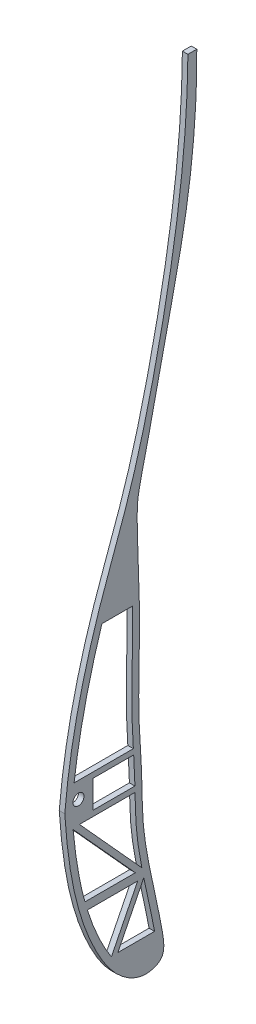
ISO-10303-21;
HEADER;
FILE_DESCRIPTION(('STEP AP214'),'2;1');
FILE_NAME('part.step','',(''),(''),'','','');
FILE_SCHEMA(('AUTOMOTIVE_DESIGN { 1 0 10303 214 1 1 1 1 }'));
ENDSEC;
DATA;
#1=APPLICATION_CONTEXT('core data for automotive mechanical design processes');
#2=APPLICATION_PROTOCOL_DEFINITION('international standard','automotive_design',2000,#1);
#3=PRODUCT_CONTEXT('',#1,'mechanical');
#4=PRODUCT('Part','Part','',(#3));
#5=PRODUCT_RELATED_PRODUCT_CATEGORY('part','',(#4));
#6=PRODUCT_DEFINITION_FORMATION('','',#4);
#7=PRODUCT_DEFINITION_CONTEXT('part definition',#1,'design');
#8=PRODUCT_DEFINITION('design','',#6,#7);
#9=PRODUCT_DEFINITION_SHAPE('','',#8);
#10=(LENGTH_UNIT() NAMED_UNIT(*) SI_UNIT(.MILLI.,.METRE.));
#11=(NAMED_UNIT(*) PLANE_ANGLE_UNIT() SI_UNIT($,.RADIAN.));
#12=(NAMED_UNIT(*) SI_UNIT($,.STERADIAN.) SOLID_ANGLE_UNIT());
#13=UNCERTAINTY_MEASURE_WITH_UNIT(LENGTH_MEASURE(1.E-05),#10,'distance_accuracy_value','');
#14=(GEOMETRIC_REPRESENTATION_CONTEXT(3) GLOBAL_UNCERTAINTY_ASSIGNED_CONTEXT((#13)) GLOBAL_UNIT_ASSIGNED_CONTEXT((#10,
#11,#12)) REPRESENTATION_CONTEXT('',''));
#15=CARTESIAN_POINT('',(0.,0.,0.));
#16=DIRECTION('',(0.,0.,1.));
#17=DIRECTION('',(1.,0.,0.));
#18=AXIS2_PLACEMENT_3D('',#15,#16,#17);
#19=CARTESIAN_POINT('',(2.,481.202019363454,-785.880852032556));
#20=DIRECTION('',(1.,0.,0.));
#21=DIRECTION('',(0.,0.,-1.));
#22=AXIS2_PLACEMENT_3D('',#19,#20,#21);
#23=PLANE('',#22);
#24=CARTESIAN_POINT('',(2.,340.385908262819,-765.512588052985));
#25=CARTESIAN_POINT('',(2.,339.008160637667,-765.942062452033));
#26=CARTESIAN_POINT('',(2.,335.196727706703,-767.22554902468));
#27=CARTESIAN_POINT('',(2.,330.291102646001,-769.261685790927));
#28=CARTESIAN_POINT('',(2.,325.640152405952,-771.608947919703));
#29=CARTESIAN_POINT('',(2.,323.059967565287,-773.096725597255));
#30=CARTESIAN_POINT('',(2.,321.674751511096,-774.004343098112));
#31=CARTESIAN_POINT('',(2.,321.355424184377,-774.220368212697));
#32=B_SPLINE_CURVE_WITH_KNOTS('',3,(#24,#25,#26,#27,#28,#29,#30,#31),.UNSPECIFIED.,.F.,.F.,(4,1,
1,1,1,4),(0.0697506622808374,0.0784831388022607,0.0941020686530699,0.101911533578474,
0.109720998503879,0.112105213874492),.UNSPECIFIED.);
#33=CARTESIAN_POINT('',(2.,340.385908262819,-765.512588052985));
#34=VERTEX_POINT('',#33);
#35=CARTESIAN_POINT('',(2.,321.355424184377,-774.220368212697));
#36=VERTEX_POINT('',#35);
#37=EDGE_CURVE('E249',#34,#36,#32,.T.);
#38=ORIENTED_EDGE('',*,*,#37,.F.);
#39=DIRECTION('',(0.,2.61948278448674E-13,1.));
#40=VECTOR('',#39,1.);
#41=CARTESIAN_POINT('',(2.,340.385908262819,-765.512588052985));
#42=LINE('',#41,#40);
#43=CARTESIAN_POINT('',(2.,340.385908262814,-783.737403402644));
#44=VERTEX_POINT('',#43);
#45=EDGE_CURVE('E257',#44,#34,#42,.T.);
#46=ORIENTED_EDGE('',*,*,#45,.F.);
#47=DIRECTION('',(0.,0.894393478705473,-0.447281013736468));
#48=VECTOR('',#47,1.);
#49=CARTESIAN_POINT('',(2.,340.385908262814,-783.737403402644));
#50=LINE('',#49,#48);
#51=EDGE_CURVE('E256',#36,#44,#50,.T.);
#52=ORIENTED_EDGE('',*,*,#51,.F.);
#53=EDGE_LOOP('',(#38,#46,#52));
#54=FACE_BOUND('',#53,.T.);
#55=DIRECTION('',(0.,0.740403338776906,0.672162849262));
#56=VECTOR('',#55,1.);
#57=CARTESIAN_POINT('',(2.,343.385908235926,-782.893255333231));
#58=LINE('',#57,#56);
#59=CARTESIAN_POINT('',(2.,343.385908235926,-782.893255333231));
#60=VERTEX_POINT('',#59);
#61=CARTESIAN_POINT('',(2.,368.21087997734,-760.356317876787));
#62=VERTEX_POINT('',#61);
#63=EDGE_CURVE('E289',#60,#62,#58,.T.);
#64=ORIENTED_EDGE('',*,*,#63,.F.);
#65=DIRECTION('',(0.,0.,-1.));
#66=VECTOR('',#65,1.);
#67=CARTESIAN_POINT('',(2.,343.385908235926,-764.629795023823));
#68=LINE('',#67,#66);
#69=CARTESIAN_POINT('',(2.,343.385908235926,-764.629795023823));
#70=VERTEX_POINT('',#69);
#71=EDGE_CURVE('E287',#70,#60,#68,.T.);
#72=ORIENTED_EDGE('',*,*,#71,.F.);
#73=CARTESIAN_POINT('',(2.,368.21087997734,-760.356317876787));
#74=CARTESIAN_POINT('',(2.,365.108328869822,-760.645542864691));
#75=CARTESIAN_POINT('',(2.,359.399798980375,-761.297099333512));
#76=CARTESIAN_POINT('',(2.,351.207948443267,-762.68556128646));
#77=CARTESIAN_POINT('',(2.,346.064289496861,-763.890877385841));
#78=CARTESIAN_POINT('',(2.,343.478926304313,-764.603996250646));
#79=CARTESIAN_POINT('',(2.,343.385908235926,-764.629795023823));
#80=B_SPLINE_CURVE_WITH_KNOTS('',3,(#73,#74,#75,#76,#77,#78,#79),.UNSPECIFIED.,.F.,.F.,(4,1,1,1,
4),(0.0131300298220132,0.0316263492498333,0.0472452791006425,0.0628642089514516,
0.0634474168728754),.UNSPECIFIED.);
#81=EDGE_CURVE('E293',#62,#70,#80,.T.);
#82=ORIENTED_EDGE('',*,*,#81,.F.);
#83=EDGE_LOOP('',(#64,#72,#82));
#84=FACE_BOUND('',#83,.T.);
#85=DIRECTION('',(0.,1.01853799661805E-12,1.));
#86=VECTOR('',#85,1.);
#87=CARTESIAN_POINT('',(2.,368.641580619222,-762.664726398492));
#88=LINE('',#87,#86);
#89=CARTESIAN_POINT('',(2.,368.641580619201,-782.775527244752));
#90=VERTEX_POINT('',#89);
#91=CARTESIAN_POINT('',(2.,368.641580619222,-762.664726398492));
#92=VERTEX_POINT('',#91);
#93=EDGE_CURVE('E336',#90,#92,#88,.T.);
#94=ORIENTED_EDGE('',*,*,#93,.F.);
#95=CARTESIAN_POINT('',(2.,343.762046235807,-785.235370080908));
#96=CARTESIAN_POINT('',(2.,345.435849462761,-784.911737530228));
#97=CARTESIAN_POINT('',(2.,348.412605530944,-784.369480265957));
#98=CARTESIAN_POINT('',(2.,352.846020065259,-783.683400447358));
#99=CARTESIAN_POINT('',(2.,358.350652792806,-783.092319972168));
#100=CARTESIAN_POINT('',(2.,363.619677576016,-782.886598015306));
#101=CARTESIAN_POINT('',(2.,367.500970974049,-782.801054433292));
#102=CARTESIAN_POINT('',(2.,368.641580619201,-782.775527244752));
#103=B_SPLINE_CURVE_WITH_KNOTS('',3,(#95,#96,#97,#98,#99,#100,#101,#102),.UNSPECIFIED.,.F.,.F.,
(4,1,1,1,1,4),(0.224345048321059,0.234672437310352,0.242481902235757,0.250291367161161,
0.26591029701197,0.272429812364704),.UNSPECIFIED.);
#104=CARTESIAN_POINT('',(2.,343.762046236129,-785.235370081016));
#105=VERTEX_POINT('',#104);
#106=EDGE_CURVE('E330',#105,#90,#103,.T.);
#107=ORIENTED_EDGE('',*,*,#106,.F.);
#108=DIRECTION('',(0.,-0.74063778163558,-0.671904514357454));
#109=VECTOR('',#108,1.);
#110=CARTESIAN_POINT('',(2.,343.762046236129,-785.235370081016));
#111=LINE('',#110,#109);
#112=EDGE_CURVE('E345',#92,#105,#111,.T.);
#113=ORIENTED_EDGE('',*,*,#112,.F.);
#114=EDGE_LOOP('',(#94,#107,#113));
#115=FACE_BOUND('',#114,.T.);
#116=DIRECTION('',(0.,-0.894393513688275,0.44728094378404));
#117=VECTOR('',#116,1.);
#118=CARTESIAN_POINT('',(2.,340.297979165982,-785.929582763325));
#119=LINE('',#118,#117);
#120=CARTESIAN_POINT('',(2.,340.297979165982,-785.929582763325));
#121=VERTEX_POINT('',#120);
#122=CARTESIAN_POINT('',(2.,321.529397961903,-776.543525523454));
#123=VERTEX_POINT('',#122);
#124=EDGE_CURVE('E374',#121,#123,#119,.T.);
#125=ORIENTED_EDGE('',*,*,#124,.F.);
#126=CARTESIAN_POINT('',(2.,321.529397961903,-789.845927053336));
#127=CARTESIAN_POINT('',(2.,321.699503823298,-789.814167011017));
#128=CARTESIAN_POINT('',(2.,322.038893566124,-789.750428920361));
#129=CARTESIAN_POINT('',(2.,323.580698572305,-789.457737754349));
#130=CARTESIAN_POINT('',(2.,326.240421286965,-788.929454000009));
#131=CARTESIAN_POINT('',(2.,329.952624524179,-788.149638114499));
#132=CARTESIAN_POINT('',(2.,333.72403688345,-787.332530561591));
#133=CARTESIAN_POINT('',(2.,337.157851053267,-786.588165074445));
#134=CARTESIAN_POINT('',(2.,339.349407118532,-786.125599329134));
#135=CARTESIAN_POINT('',(2.,340.297979165982,-785.929582763325));
#136=B_SPLINE_CURVE_WITH_KNOTS('',3,(#126,#127,#128,#129,#130,#131,#132,#133,#134,#135),
.UNSPECIFIED.,.F.,.F.,(4,1,1,1,1,1,1,4),(0.178917784035079,0.179893967151298,0.180870150266974,
0.187815647757925,0.195625112683329,0.203434577608734,0.211244042534138,0.217170107358208),.UNSPECIFIED.);
#137=CARTESIAN_POINT('',(2.,321.529397961903,-789.845927053336));
#138=VERTEX_POINT('',#137);
#139=EDGE_CURVE('E369',#138,#121,#136,.T.);
#140=ORIENTED_EDGE('',*,*,#139,.F.);
#141=DIRECTION('',(0.,0.,-1.));
#142=VECTOR('',#141,1.);
#143=CARTESIAN_POINT('',(2.,321.529397961903,-776.543525523454));
#144=LINE('',#143,#142);
#145=EDGE_CURVE('E496',#123,#138,#144,.T.);
#146=ORIENTED_EDGE('',*,*,#145,.F.);
#147=EDGE_LOOP('',(#125,#140,#146));
#148=FACE_BOUND('',#147,.T.);
#149=DIRECTION('',(0.,0.,-1.));
#150=VECTOR('',#149,1.);
#151=CARTESIAN_POINT('',(2.,382.641580619201,-760.713816226627));
#152=LINE('',#151,#150);
#153=CARTESIAN_POINT('',(2.,382.641580619201,-760.713816226627));
#154=VERTEX_POINT('',#153);
#155=CARTESIAN_POINT('',(2.,382.641580619201,-782.158524772029));
#156=VERTEX_POINT('',#155);
#157=EDGE_CURVE('E405',#154,#156,#152,.T.);
#158=ORIENTED_EDGE('',*,*,#157,.F.);
#159=CARTESIAN_POINT('',(2.,427.491820966125,-770.78664309846));
#160=CARTESIAN_POINT('',(2.,423.33866525662,-769.467056163945));
#161=CARTESIAN_POINT('',(2.,414.7700614056,-766.964736871384));
#162=CARTESIAN_POINT('',(2.,399.851527625685,-763.380449780048));
#163=CARTESIAN_POINT('',(2.,389.014059475878,-761.525068294202));
#164=CARTESIAN_POINT('',(2.,382.641580619201,-760.713816226627));
#165=B_SPLINE_CURVE_WITH_KNOTS('',3,(#159,#160,#161,#162,#163,#164),.UNSPECIFIED.,.F.,.F.,(4,1,
1,4),(0.75216752707801,0.811772657665889,0.874216708255573,0.962264248056751),.UNSPECIFIED.);
#166=CARTESIAN_POINT('',(2.,427.491820966125,-770.78664309846));
#167=VERTEX_POINT('',#166);
#168=EDGE_CURVE('E435',#167,#154,#165,.T.);
#169=ORIENTED_EDGE('',*,*,#168,.F.);
#170=DIRECTION('',(0.,0.,1.));
#171=VECTOR('',#170,1.);
#172=CARTESIAN_POINT('',(2.,427.491820966125,-770.78664309846));
#173=LINE('',#172,#171);
#174=CARTESIAN_POINT('',(2.,427.491820966125,-781.8143913991));
#175=VERTEX_POINT('',#174);
#176=EDGE_CURVE('E404',#175,#167,#173,.T.);
#177=ORIENTED_EDGE('',*,*,#176,.F.);
#178=CARTESIAN_POINT('',(2.,382.641580619201,-782.158524772029));
#179=CARTESIAN_POINT('',(2.,384.984999743043,-782.009801346982));
#180=CARTESIAN_POINT('',(2.,392.72879678058,-781.532269832097));
#181=CARTESIAN_POINT('',(2.,402.504492041581,-781.601558596643));
#182=CARTESIAN_POINT('',(2.,413.028444882909,-781.812144771197));
#183=CARTESIAN_POINT('',(2.,420.046613203179,-781.889539878955));
#184=CARTESIAN_POINT('',(2.,425.00787778219,-781.856336873659));
#185=CARTESIAN_POINT('',(2.,427.030653456843,-781.822920811895));
#186=CARTESIAN_POINT('',(2.,427.491820966125,-781.8143913991));
#187=B_SPLINE_CURVE_WITH_KNOTS('',3,(#178,#179,#180,#181,#182,#183,#184,#185,#186),
.UNSPECIFIED.,.F.,.F.,(4,1,1,1,1,1,4),(0.299279434855956,0.312767086564398,0.344004946266016,
0.359623876116825,0.375242805967634,0.383052270893039,0.385336265488092),.UNSPECIFIED.);
#188=EDGE_CURVE('E397',#156,#175,#187,.T.);
#189=ORIENTED_EDGE('',*,*,#188,.F.);
#190=EDGE_LOOP('',(#158,#169,#177,#189));
#191=FACE_BOUND('',#190,.T.);
#192=CARTESIAN_POINT('',(2.,590.408064710771,-801.906188373582));
#193=CARTESIAN_POINT('',(2.,560.152145615693,-801.696580445326));
#194=CARTESIAN_POINT('',(2.,516.437213248744,-794.998743298671));
#195=CARTESIAN_POINT('',(2.,464.922235888547,-781.936959969809));
#196=CARTESIAN_POINT('',(2.,424.310340527531,-766.027657555779));
#197=CARTESIAN_POINT('',(2.,395.318637871251,-759.177489387421));
#198=CARTESIAN_POINT('',(2.,374.654040422638,-757.334151871242));
#199=B_SPLINE_CURVE_WITH_KNOTS('',3,(#192,#193,#194,#195,#196,#197,#198),.UNSPECIFIED.,.F.,.F.,
(4,1,1,1,4),(0.,0.40882599508886,0.59851771432939,0.719267244538079,1.),.UNSPECIFIED.);
#200=CARTESIAN_POINT('',(2.,590.408064710771,-801.906188373582));
#201=VERTEX_POINT('',#200);
#202=CARTESIAN_POINT('',(2.,374.654040422638,-757.334151871242));
#203=VERTEX_POINT('',#202);
#204=EDGE_CURVE('E445',#201,#203,#199,.T.);
#205=ORIENTED_EDGE('',*,*,#204,.T.);
#206=CARTESIAN_POINT('',(2.,374.654040422638,-757.334151871242));
#207=CARTESIAN_POINT('',(2.,357.641582882345,-758.488618023892));
#208=CARTESIAN_POINT('',(2.,335.0381499136,-761.828045075014));
#209=CARTESIAN_POINT('',(2.,313.183311775303,-776.364446291571));
#210=CARTESIAN_POINT('',(2.,308.841980468108,-785.880697371213));
#211=CARTESIAN_POINT('',(2.,310.610251685068,-791.313928595472));
#212=CARTESIAN_POINT('',(2.,312.987941846461,-793.075385029442));
#213=CARTESIAN_POINT('',(2.,316.107743129073,-793.337462446664));
#214=CARTESIAN_POINT('',(2.,329.643146103394,-791.041438182055));
#215=CARTESIAN_POINT('',(2.,341.196605560739,-787.95599236507));
#216=CARTESIAN_POINT('',(2.,359.620713161168,-785.204159750693));
#217=CARTESIAN_POINT('',(2.,372.997065252505,-785.453788794671));
#218=CARTESIAN_POINT('',(2.,397.430131693857,-783.431517771397));
#219=CARTESIAN_POINT('',(2.,420.762517316124,-785.24761534817));
#220=CARTESIAN_POINT('',(2.,455.809656019197,-783.053458862603));
#221=CARTESIAN_POINT('',(2.,464.386743167617,-784.469445240221));
#222=CARTESIAN_POINT('',(2.,479.293540681458,-788.132816832003));
#223=CARTESIAN_POINT('',(2.,503.980467437628,-793.242767846079));
#224=CARTESIAN_POINT('',(2.,542.605359529919,-802.54005693684));
#225=CARTESIAN_POINT('',(2.,572.394099522504,-805.258661066609));
#226=CARTESIAN_POINT('',(2.,590.408064710771,-805.114959311522));
#227=B_SPLINE_CURVE_WITH_KNOTS('',3,(#206,#207,#208,#209,#210,#211,#212,#213,#214,#215,#216,
#217,#218,#219,#220,#221,#222,#223,#224,#225,#226),.UNSPECIFIED.,.F.,.F.,(4,1,1,1,1,1,1,1,1,1,1,
1,1,1,1,1,1,1,4),(0.,0.100347506498937,0.132199535267225,0.149145767340533,0.158795902968277,
0.160733944755249,0.167660380715246,0.175846516855138,0.234409170014273,0.24607012832152,
0.285135768282719,0.310616456213291,0.385264397934258,0.441942427351935,0.454032525104892,
0.506165375463829,0.624061375943607,0.777474310688583,1.),.UNSPECIFIED.);
#228=CARTESIAN_POINT('',(2.,590.408064710771,-805.114959311522));
#229=VERTEX_POINT('',#228);
#230=EDGE_CURVE('E451',#203,#229,#227,.T.);
#231=ORIENTED_EDGE('',*,*,#230,.T.);
#232=DIRECTION('',(0.,0.,1.));
#233=VECTOR('',#232,1.);
#234=CARTESIAN_POINT('',(2.,590.408064710771,-801.906188373582));
#235=LINE('',#234,#233);
#236=EDGE_CURVE('E460',#229,#201,#235,.T.);
#237=ORIENTED_EDGE('',*,*,#236,.T.);
#238=EDGE_LOOP('',(#205,#231,#237));
#239=FACE_BOUND('',#238,.T.);
#240=CARTESIAN_POINT('',(2.,376.641580619201,-762.28949999316));
#241=DIRECTION('',(1.,0.,0.));
#242=DIRECTION('',(0.,0.,-1.));
#243=AXIS2_PLACEMENT_3D('',#240,#241,#242);
#244=CIRCLE('',#243,2.);
#245=CARTESIAN_POINT('',(2.,376.641580619201,-764.28949999316));
#246=VERTEX_POINT('',#245);
#247=EDGE_CURVE('E268',#246,#246,#244,.T.);
#248=ORIENTED_EDGE('',*,*,#247,.F.);
#249=EDGE_LOOP('',(#248));
#250=FACE_BOUND('',#249,.T.);
#251=DIRECTION('',(0.,-1.,0.));
#252=VECTOR('',#251,1.);
#253=CARTESIAN_POINT('',(2.,380.641580619201,-767.571939026823));
#254=LINE('',#253,#252);
#255=CARTESIAN_POINT('',(2.,380.641580619201,-767.571939026823));
#256=VERTEX_POINT('',#255);
#257=CARTESIAN_POINT('',(2.,370.641580619201,-767.571939026823));
#258=VERTEX_POINT('',#257);
#259=EDGE_CURVE('E197',#256,#258,#254,.T.);
#260=ORIENTED_EDGE('',*,*,#259,.F.);
#261=DIRECTION('',(0.,0.,1.));
#262=VECTOR('',#261,1.);
#263=CARTESIAN_POINT('',(2.,380.641580619201,-767.571939026823));
#264=LINE('',#263,#262);
#265=CARTESIAN_POINT('',(2.,380.641580619201,-782.28548229842));
#266=VERTEX_POINT('',#265);
#267=EDGE_CURVE('E189',#266,#256,#264,.T.);
#268=ORIENTED_EDGE('',*,*,#267,.F.);
#269=CARTESIAN_POINT('',(2.,370.641580619201,-782.729137506047));
#270=CARTESIAN_POINT('',(2.,371.563392328796,-782.706435659239));
#271=CARTESIAN_POINT('',(2.,373.842636010294,-782.643817690012));
#272=CARTESIAN_POINT('',(2.,377.160810260957,-782.499614967796));
#273=CARTESIAN_POINT('',(2.,379.579890206761,-782.352274740881));
#274=CARTESIAN_POINT('',(2.,380.641580619201,-782.28548229842));
#275=B_SPLINE_CURVE_WITH_KNOTS('',3,(#269,#270,#271,#272,#273,#274),.UNSPECIFIED.,.F.,.F.,(4,1,
1,4),(0.276245485102746,0.28152922686278,0.289338691788184,0.295444603811265),.UNSPECIFIED.);
#276=CARTESIAN_POINT('',(2.,370.641580619201,-782.729137506047));
#277=VERTEX_POINT('',#276);
#278=EDGE_CURVE('E211',#277,#266,#275,.T.);
#279=ORIENTED_EDGE('',*,*,#278,.F.);
#280=DIRECTION('',(0.,0.,-1.));
#281=VECTOR('',#280,1.);
#282=CARTESIAN_POINT('',(2.,370.641580619201,-767.571939026823));
#283=LINE('',#282,#281);
#284=EDGE_CURVE('E209',#258,#277,#283,.T.);
#285=ORIENTED_EDGE('',*,*,#284,.F.);
#286=EDGE_LOOP('',(#260,#268,#279,#285));
#287=FACE_BOUND('',#286,.T.);
#288=ADVANCED_FACE('F33',(#54,#84,#115,#148,#191,#239,#250,#287),#23,.T.);
#289=CARTESIAN_POINT('',(0.,481.202019363454,-785.880852032556));
#290=DIRECTION('',(1.,0.,0.));
#291=DIRECTION('',(0.,0.,-1.));
#292=AXIS2_PLACEMENT_3D('',#289,#290,#291);
#293=PLANE('',#292);
#294=CARTESIAN_POINT('',(0.,376.641580619201,-762.28949999316));
#295=DIRECTION('',(1.,0.,0.));
#296=DIRECTION('',(0.,0.,-1.));
#297=AXIS2_PLACEMENT_3D('',#294,#295,#296);
#298=CIRCLE('',#297,2.);
#299=CARTESIAN_POINT('',(0.,376.641580619201,-764.28949999316));
#300=VERTEX_POINT('',#299);
#301=EDGE_CURVE('E205',#300,#300,#298,.T.);
#302=ORIENTED_EDGE('',*,*,#301,.T.);
#303=EDGE_LOOP('',(#302));
#304=FACE_BOUND('',#303,.T.);
#305=DIRECTION('',(0.,2.61948278448674E-13,1.));
#306=VECTOR('',#305,1.);
#307=CARTESIAN_POINT('',(0.,340.385908262819,-765.512588052985));
#308=LINE('',#307,#306);
#309=CARTESIAN_POINT('',(0.,340.385908262814,-783.737403402644));
#310=VERTEX_POINT('',#309);
#311=CARTESIAN_POINT('',(0.,340.385908262819,-765.512588052985));
#312=VERTEX_POINT('',#311);
#313=EDGE_CURVE('E264',#310,#312,#308,.T.);
#314=ORIENTED_EDGE('',*,*,#313,.T.);
#315=CARTESIAN_POINT('',(0.,340.385908262819,-765.512588052985));
#316=CARTESIAN_POINT('',(0.,339.008160637667,-765.942062452033));
#317=CARTESIAN_POINT('',(0.,335.196727706703,-767.22554902468));
#318=CARTESIAN_POINT('',(0.,330.291102646001,-769.261685790927));
#319=CARTESIAN_POINT('',(0.,325.640152405952,-771.608947919703));
#320=CARTESIAN_POINT('',(0.,323.059967565287,-773.096725597255));
#321=CARTESIAN_POINT('',(0.,321.674751511096,-774.004343098112));
#322=CARTESIAN_POINT('',(0.,321.355424184377,-774.220368212697));
#323=B_SPLINE_CURVE_WITH_KNOTS('',3,(#315,#316,#317,#318,#319,#320,#321,#322),.UNSPECIFIED.,.F.,
.F.,(4,1,1,1,1,4),(0.0697506622808374,0.0784831388022607,0.0941020686530699,0.101911533578474,
0.109720998503879,0.112105213874492),.UNSPECIFIED.);
#324=CARTESIAN_POINT('',(0.,321.355424184377,-774.220368212697));
#325=VERTEX_POINT('',#324);
#326=EDGE_CURVE('E267',#312,#325,#323,.T.);
#327=ORIENTED_EDGE('',*,*,#326,.T.);
#328=DIRECTION('',(0.,0.894393478705473,-0.447281013736468));
#329=VECTOR('',#328,1.);
#330=CARTESIAN_POINT('',(0.,340.385908262814,-783.737403402644));
#331=LINE('',#330,#329);
#332=EDGE_CURVE('E273',#325,#310,#331,.T.);
#333=ORIENTED_EDGE('',*,*,#332,.T.);
#334=EDGE_LOOP('',(#314,#327,#333));
#335=FACE_BOUND('',#334,.T.);
#336=CARTESIAN_POINT('',(0.,343.762046235807,-785.235370080908));
#337=CARTESIAN_POINT('',(0.,345.435849462761,-784.911737530228));
#338=CARTESIAN_POINT('',(0.,348.412605530944,-784.369480265957));
#339=CARTESIAN_POINT('',(0.,352.846020065259,-783.683400447358));
#340=CARTESIAN_POINT('',(0.,358.350652792806,-783.092319972168));
#341=CARTESIAN_POINT('',(0.,363.619677576016,-782.886598015306));
#342=CARTESIAN_POINT('',(0.,367.500970974049,-782.801054433292));
#343=CARTESIAN_POINT('',(0.,368.641580619201,-782.775527244752));
#344=B_SPLINE_CURVE_WITH_KNOTS('',3,(#336,#337,#338,#339,#340,#341,#342,#343),.UNSPECIFIED.,.F.,
.F.,(4,1,1,1,1,4),(0.224345048321059,0.234672437310352,0.242481902235757,0.250291367161161,
0.26591029701197,0.272429812364704),.UNSPECIFIED.);
#345=CARTESIAN_POINT('',(0.,343.762046236129,-785.235370081016));
#346=VERTEX_POINT('',#345);
#347=CARTESIAN_POINT('',(0.,368.641580619201,-782.775527244752));
#348=VERTEX_POINT('',#347);
#349=EDGE_CURVE('E348',#346,#348,#344,.T.);
#350=ORIENTED_EDGE('',*,*,#349,.T.);
#351=DIRECTION('',(0.,1.01853799661805E-12,1.));
#352=VECTOR('',#351,1.);
#353=CARTESIAN_POINT('',(0.,368.641580619222,-762.664726398492));
#354=LINE('',#353,#352);
#355=CARTESIAN_POINT('',(0.,368.641580619222,-762.664726398492));
#356=VERTEX_POINT('',#355);
#357=EDGE_CURVE('E353',#348,#356,#354,.T.);
#358=ORIENTED_EDGE('',*,*,#357,.T.);
#359=DIRECTION('',(0.,-0.74063778163558,-0.671904514357454));
#360=VECTOR('',#359,1.);
#361=CARTESIAN_POINT('',(0.,343.762046236129,-785.235370081016));
#362=LINE('',#361,#360);
#363=EDGE_CURVE('E337',#356,#346,#362,.T.);
#364=ORIENTED_EDGE('',*,*,#363,.T.);
#365=EDGE_LOOP('',(#350,#358,#364));
#366=FACE_BOUND('',#365,.T.);
#367=CARTESIAN_POINT('',(0.,427.491820966125,-770.78664309846));
#368=CARTESIAN_POINT('',(0.,423.33866525662,-769.467056163945));
#369=CARTESIAN_POINT('',(0.,414.7700614056,-766.964736871384));
#370=CARTESIAN_POINT('',(0.,399.851527625685,-763.380449780048));
#371=CARTESIAN_POINT('',(0.,389.014059475878,-761.525068294202));
#372=CARTESIAN_POINT('',(0.,382.641580619201,-760.713816226627));
#373=B_SPLINE_CURVE_WITH_KNOTS('',3,(#367,#368,#369,#370,#371,#372),.UNSPECIFIED.,.F.,.F.,(4,1,
1,4),(0.75216752707801,0.811772657665889,0.874216708255573,0.962264248056751),.UNSPECIFIED.);
#374=CARTESIAN_POINT('',(0.,427.491820966125,-770.78664309846));
#375=VERTEX_POINT('',#374);
#376=CARTESIAN_POINT('',(0.,382.641580619201,-760.713816226627));
#377=VERTEX_POINT('',#376);
#378=EDGE_CURVE('E412',#375,#377,#373,.T.);
#379=ORIENTED_EDGE('',*,*,#378,.T.);
#380=DIRECTION('',(0.,0.,-1.));
#381=VECTOR('',#380,1.);
#382=CARTESIAN_POINT('',(0.,382.641580619201,-760.713816226627));
#383=LINE('',#382,#381);
#384=CARTESIAN_POINT('',(0.,382.641580619201,-782.158524772029));
#385=VERTEX_POINT('',#384);
#386=EDGE_CURVE('E417',#377,#385,#383,.T.);
#387=ORIENTED_EDGE('',*,*,#386,.T.);
#388=CARTESIAN_POINT('',(0.,382.641580619201,-782.158524772029));
#389=CARTESIAN_POINT('',(0.,384.984999743043,-782.009801346982));
#390=CARTESIAN_POINT('',(0.,392.72879678058,-781.532269832097));
#391=CARTESIAN_POINT('',(0.,402.504492041581,-781.601558596643));
#392=CARTESIAN_POINT('',(0.,413.028444882909,-781.812144771197));
#393=CARTESIAN_POINT('',(0.,420.046613203179,-781.889539878955));
#394=CARTESIAN_POINT('',(0.,425.00787778219,-781.856336873659));
#395=CARTESIAN_POINT('',(0.,427.030653456843,-781.822920811895));
#396=CARTESIAN_POINT('',(0.,427.491820966125,-781.8143913991));
#397=B_SPLINE_CURVE_WITH_KNOTS('',3,(#388,#389,#390,#391,#392,#393,#394,#395,#396),
.UNSPECIFIED.,.F.,.F.,(4,1,1,1,1,1,4),(0.299279434855956,0.312767086564398,0.344004946266016,
0.359623876116825,0.375242805967634,0.383052270893039,0.385336265488092),.UNSPECIFIED.);
#398=CARTESIAN_POINT('',(0.,427.491820966125,-781.8143913991));
#399=VERTEX_POINT('',#398);
#400=EDGE_CURVE('E424',#385,#399,#397,.T.);
#401=ORIENTED_EDGE('',*,*,#400,.T.);
#402=DIRECTION('',(0.,0.,1.));
#403=VECTOR('',#402,1.);
#404=CARTESIAN_POINT('',(0.,427.491820966125,-770.78664309846));
#405=LINE('',#404,#403);
#406=EDGE_CURVE('E429',#399,#375,#405,.T.);
#407=ORIENTED_EDGE('',*,*,#406,.T.);
#408=EDGE_LOOP('',(#379,#387,#401,#407));
#409=FACE_BOUND('',#408,.T.);
#410=CARTESIAN_POINT('',(0.,590.408064710771,-801.906188373582));
#411=CARTESIAN_POINT('',(0.,560.152145615693,-801.696580445326));
#412=CARTESIAN_POINT('',(0.,516.437213248744,-794.998743298671));
#413=CARTESIAN_POINT('',(0.,464.922235888547,-781.936959969809));
#414=CARTESIAN_POINT('',(0.,424.310340527531,-766.027657555779));
#415=CARTESIAN_POINT('',(0.,395.318637871251,-759.177489387421));
#416=CARTESIAN_POINT('',(0.,374.654040422638,-757.334151871242));
#417=B_SPLINE_CURVE_WITH_KNOTS('',3,(#410,#411,#412,#413,#414,#415,#416),.UNSPECIFIED.,.F.,.F.,
(4,1,1,1,4),(0.,0.40882599508886,0.59851771432939,0.719267244538079,1.),.UNSPECIFIED.);
#418=CARTESIAN_POINT('',(0.,590.408064710771,-801.906188373582));
#419=VERTEX_POINT('',#418);
#420=CARTESIAN_POINT('',(0.,374.654040422638,-757.334151871242));
#421=VERTEX_POINT('',#420);
#422=EDGE_CURVE('E444',#419,#421,#417,.T.);
#423=ORIENTED_EDGE('',*,*,#422,.F.);
#424=DIRECTION('',(0.,0.,1.));
#425=VECTOR('',#424,1.);
#426=CARTESIAN_POINT('',(0.,590.408064710771,-801.906188373582));
#427=LINE('',#426,#425);
#428=CARTESIAN_POINT('',(0.,590.408064710771,-805.114959311522));
#429=VERTEX_POINT('',#428);
#430=EDGE_CURVE('E452',#429,#419,#427,.T.);
#431=ORIENTED_EDGE('',*,*,#430,.F.);
#432=CARTESIAN_POINT('',(0.,374.654040422638,-757.334151871242));
#433=CARTESIAN_POINT('',(0.,357.641582882345,-758.488618023892));
#434=CARTESIAN_POINT('',(0.,335.0381499136,-761.828045075014));
#435=CARTESIAN_POINT('',(0.,313.183311775303,-776.364446291571));
#436=CARTESIAN_POINT('',(0.,308.841980468108,-785.880697371213));
#437=CARTESIAN_POINT('',(0.,310.610251685068,-791.313928595472));
#438=CARTESIAN_POINT('',(0.,312.987941846461,-793.075385029442));
#439=CARTESIAN_POINT('',(0.,316.107743129073,-793.337462446664));
#440=CARTESIAN_POINT('',(0.,329.643146103394,-791.041438182055));
#441=CARTESIAN_POINT('',(0.,341.196605560739,-787.95599236507));
#442=CARTESIAN_POINT('',(0.,359.620713161168,-785.204159750693));
#443=CARTESIAN_POINT('',(0.,372.997065252505,-785.453788794671));
#444=CARTESIAN_POINT('',(0.,397.430131693857,-783.431517771397));
#445=CARTESIAN_POINT('',(0.,420.762517316124,-785.24761534817));
#446=CARTESIAN_POINT('',(0.,455.809656019197,-783.053458862603));
#447=CARTESIAN_POINT('',(0.,464.386743167617,-784.469445240221));
#448=CARTESIAN_POINT('',(0.,479.293540681458,-788.132816832003));
#449=CARTESIAN_POINT('',(0.,503.980467437628,-793.242767846079));
#450=CARTESIAN_POINT('',(0.,542.605359529919,-802.54005693684));
#451=CARTESIAN_POINT('',(0.,572.394099522504,-805.258661066609));
#452=CARTESIAN_POINT('',(0.,590.408064710771,-805.114959311522));
#453=B_SPLINE_CURVE_WITH_KNOTS('',3,(#432,#433,#434,#435,#436,#437,#438,#439,#440,#441,#442,
#443,#444,#445,#446,#447,#448,#449,#450,#451,#452),.UNSPECIFIED.,.F.,.F.,(4,1,1,1,1,1,1,1,1,1,1,
1,1,1,1,1,1,1,4),(0.,0.100347506498937,0.132199535267225,0.149145767340533,0.158795902968277,
0.160733944755249,0.167660380715246,0.175846516855138,0.234409170014273,0.24607012832152,
0.285135768282719,0.310616456213291,0.385264397934258,0.441942427351935,0.454032525104892,
0.506165375463829,0.624061375943607,0.777474310688583,1.),.UNSPECIFIED.);
#454=EDGE_CURVE('E550',#421,#429,#453,.T.);
#455=ORIENTED_EDGE('',*,*,#454,.F.);
#456=EDGE_LOOP('',(#423,#431,#455));
#457=FACE_BOUND('',#456,.T.);
#458=CARTESIAN_POINT('',(0.,321.529397961903,-789.845927053336));
#459=CARTESIAN_POINT('',(0.,321.699503823298,-789.814167011017));
#460=CARTESIAN_POINT('',(0.,322.038893566124,-789.750428920361));
#461=CARTESIAN_POINT('',(0.,323.580698572305,-789.457737754349));
#462=CARTESIAN_POINT('',(0.,326.240421286965,-788.929454000009));
#463=CARTESIAN_POINT('',(0.,329.952624524179,-788.149638114499));
#464=CARTESIAN_POINT('',(0.,333.72403688345,-787.332530561591));
#465=CARTESIAN_POINT('',(0.,337.157851053267,-786.588165074445));
#466=CARTESIAN_POINT('',(0.,339.349407118532,-786.125599329134));
#467=CARTESIAN_POINT('',(0.,340.297979165982,-785.929582763325));
#468=B_SPLINE_CURVE_WITH_KNOTS('',3,(#458,#459,#460,#461,#462,#463,#464,#465,#466,#467),
.UNSPECIFIED.,.F.,.F.,(4,1,1,1,1,1,1,4),(0.178917784035079,0.179893967151298,0.180870150266974,
0.187815647757925,0.195625112683329,0.203434577608734,0.211244042534138,0.217170107358208),.UNSPECIFIED.);
#469=CARTESIAN_POINT('',(0.,321.529397961903,-789.845927053336));
#470=VERTEX_POINT('',#469);
#471=CARTESIAN_POINT('',(0.,340.297979165982,-785.929582763325));
#472=VERTEX_POINT('',#471);
#473=EDGE_CURVE('E368',#470,#472,#468,.T.);
#474=ORIENTED_EDGE('',*,*,#473,.T.);
#475=DIRECTION('',(0.,-0.894393513688275,0.44728094378404));
#476=VECTOR('',#475,1.);
#477=CARTESIAN_POINT('',(0.,340.297979165982,-785.929582763325));
#478=LINE('',#477,#476);
#479=CARTESIAN_POINT('',(0.,321.529397961903,-776.543525523454));
#480=VERTEX_POINT('',#479);
#481=EDGE_CURVE('E499',#472,#480,#478,.T.);
#482=ORIENTED_EDGE('',*,*,#481,.T.);
#483=DIRECTION('',(0.,0.,-1.));
#484=VECTOR('',#483,1.);
#485=CARTESIAN_POINT('',(0.,321.529397961903,-776.543525523454));
#486=LINE('',#485,#484);
#487=EDGE_CURVE('E375',#480,#470,#486,.T.);
#488=ORIENTED_EDGE('',*,*,#487,.T.);
#489=EDGE_LOOP('',(#474,#482,#488));
#490=FACE_BOUND('',#489,.T.);
#491=DIRECTION('',(0.,0.,-1.));
#492=VECTOR('',#491,1.);
#493=CARTESIAN_POINT('',(0.,343.385908235926,-764.629795023823));
#494=LINE('',#493,#492);
#495=CARTESIAN_POINT('',(0.,343.385908235926,-764.629795023823));
#496=VERTEX_POINT('',#495);
#497=CARTESIAN_POINT('',(0.,343.385908235926,-782.893255333231));
#498=VERTEX_POINT('',#497);
#499=EDGE_CURVE('E286',#496,#498,#494,.T.);
#500=ORIENTED_EDGE('',*,*,#499,.T.);
#501=DIRECTION('',(0.,0.740403338776906,0.672162849262));
#502=VECTOR('',#501,1.);
#503=CARTESIAN_POINT('',(0.,343.385908235926,-782.893255333231));
#504=LINE('',#503,#502);
#505=CARTESIAN_POINT('',(0.,368.21087997734,-760.356317876787));
#506=VERTEX_POINT('',#505);
#507=EDGE_CURVE('E760',#498,#506,#504,.T.);
#508=ORIENTED_EDGE('',*,*,#507,.T.);
#509=CARTESIAN_POINT('',(0.,368.21087997734,-760.356317876787));
#510=CARTESIAN_POINT('',(0.,365.108328869822,-760.645542864691));
#511=CARTESIAN_POINT('',(0.,359.399798980375,-761.297099333512));
#512=CARTESIAN_POINT('',(0.,351.207948443267,-762.68556128646));
#513=CARTESIAN_POINT('',(0.,346.064289496861,-763.890877385841));
#514=CARTESIAN_POINT('',(0.,343.478926304313,-764.603996250646));
#515=CARTESIAN_POINT('',(0.,343.385908235926,-764.629795023823));
#516=B_SPLINE_CURVE_WITH_KNOTS('',3,(#509,#510,#511,#512,#513,#514,#515),.UNSPECIFIED.,.F.,.F.,
(4,1,1,1,4),(0.0131300298220132,0.0316263492498333,0.0472452791006425,0.0628642089514516,
0.0634474168728754),.UNSPECIFIED.);
#517=EDGE_CURVE('E290',#506,#496,#516,.T.);
#518=ORIENTED_EDGE('',*,*,#517,.T.);
#519=EDGE_LOOP('',(#500,#508,#518));
#520=FACE_BOUND('',#519,.T.);
#521=DIRECTION('',(0.,0.,1.));
#522=VECTOR('',#521,1.);
#523=CARTESIAN_POINT('',(0.,380.641580619201,-767.571939026823));
#524=LINE('',#523,#522);
#525=CARTESIAN_POINT('',(0.,380.641580619201,-782.28548229842));
#526=VERTEX_POINT('',#525);
#527=CARTESIAN_POINT('',(0.,380.641580619201,-767.571939026823));
#528=VERTEX_POINT('',#527);
#529=EDGE_CURVE('E57',#526,#528,#524,.T.);
#530=ORIENTED_EDGE('',*,*,#529,.T.);
#531=DIRECTION('',(0.,-1.,0.));
#532=VECTOR('',#531,1.);
#533=CARTESIAN_POINT('',(0.,380.641580619201,-767.571939026823));
#534=LINE('',#533,#532);
#535=CARTESIAN_POINT('',(0.,370.641580619201,-767.571939026823));
#536=VERTEX_POINT('',#535);
#537=EDGE_CURVE('E204',#528,#536,#534,.T.);
#538=ORIENTED_EDGE('',*,*,#537,.T.);
#539=DIRECTION('',(0.,0.,-1.));
#540=VECTOR('',#539,1.);
#541=CARTESIAN_POINT('',(0.,370.641580619201,-767.571939026823));
#542=LINE('',#541,#540);
#543=CARTESIAN_POINT('',(0.,370.641580619201,-782.729137506047));
#544=VERTEX_POINT('',#543);
#545=EDGE_CURVE('E527',#536,#544,#542,.T.);
#546=ORIENTED_EDGE('',*,*,#545,.T.);
#547=CARTESIAN_POINT('',(0.,370.641580619201,-782.729137506047));
#548=CARTESIAN_POINT('',(0.,371.563392328796,-782.706435659239));
#549=CARTESIAN_POINT('',(0.,373.842636010294,-782.643817690012));
#550=CARTESIAN_POINT('',(0.,377.160810260957,-782.499614967796));
#551=CARTESIAN_POINT('',(0.,379.579890206761,-782.352274740881));
#552=CARTESIAN_POINT('',(0.,380.641580619201,-782.28548229842));
#553=B_SPLINE_CURVE_WITH_KNOTS('',3,(#547,#548,#549,#550,#551,#552),.UNSPECIFIED.,.F.,.F.,(4,1,
1,4),(0.276245485102746,0.28152922686278,0.289338691788184,0.295444603811265),.UNSPECIFIED.);
#554=EDGE_CURVE('E198',#544,#526,#553,.T.);
#555=ORIENTED_EDGE('',*,*,#554,.T.);
#556=EDGE_LOOP('',(#530,#538,#546,#555));
#557=FACE_BOUND('',#556,.T.);
#558=ADVANCED_FACE('F474',(#304,#335,#366,#409,#457,#490,#520,#557),#293,.F.);
#559=DIRECTION('',(-1.,0.,0.));
#560=VECTOR('',#559,1.);
#561=SURFACE_OF_LINEAR_EXTRUSION('',#199,#560);
#562=ORIENTED_EDGE('',*,*,#422,.T.);
#563=DIRECTION('',(-1.,0.,0.));
#564=VECTOR('',#563,1.);
#565=CARTESIAN_POINT('',(2.,374.654040422638,-757.334151871242));
#566=LINE('',#565,#564);
#567=EDGE_CURVE('E11',#203,#421,#566,.T.);
#568=ORIENTED_EDGE('',*,*,#567,.F.);
#569=ORIENTED_EDGE('',*,*,#204,.F.);
#570=DIRECTION('',(-1.,0.,0.));
#571=VECTOR('',#570,1.);
#572=CARTESIAN_POINT('',(2.,590.408064710771,-801.906188373582));
#573=LINE('',#572,#571);
#574=EDGE_CURVE('E567',#201,#419,#573,.T.);
#575=ORIENTED_EDGE('',*,*,#574,.T.);
#576=EDGE_LOOP('',(#562,#568,#569,#575));
#577=FACE_BOUND('',#576,.T.);
#578=ADVANCED_FACE('F35',(#577),#561,.F.);
#579=DIRECTION('',(-1.,0.,0.));
#580=VECTOR('',#579,1.);
#581=SURFACE_OF_LINEAR_EXTRUSION('',#227,#580);
#582=ORIENTED_EDGE('',*,*,#454,.T.);
#583=DIRECTION('',(-1.,0.,0.));
#584=VECTOR('',#583,1.);
#585=CARTESIAN_POINT('',(2.,590.408064710771,-805.114959311522));
#586=LINE('',#585,#584);
#587=EDGE_CURVE('E42',#229,#429,#586,.T.);
#588=ORIENTED_EDGE('',*,*,#587,.F.);
#589=ORIENTED_EDGE('',*,*,#230,.F.);
#590=ORIENTED_EDGE('',*,*,#567,.T.);
#591=EDGE_LOOP('',(#582,#588,#589,#590));
#592=FACE_BOUND('',#591,.T.);
#593=ADVANCED_FACE('F465',(#592),#581,.F.);
#594=CARTESIAN_POINT('',(2.,590.408064710771,-801.906188373582));
#595=DIRECTION('',(0.,-1.,0.));
#596=DIRECTION('',(0.,0.,-1.));
#597=AXIS2_PLACEMENT_3D('',#594,#595,#596);
#598=PLANE('',#597);
#599=ORIENTED_EDGE('',*,*,#430,.T.);
#600=ORIENTED_EDGE('',*,*,#574,.F.);
#601=ORIENTED_EDGE('',*,*,#236,.F.);
#602=ORIENTED_EDGE('',*,*,#587,.T.);
#603=EDGE_LOOP('',(#599,#600,#601,#602));
#604=FACE_BOUND('',#603,.T.);
#605=ADVANCED_FACE('F468',(#604),#598,.F.);
#606=DIRECTION('',(-1.,0.,0.));
#607=VECTOR('',#606,1.);
#608=SURFACE_OF_LINEAR_EXTRUSION('',#165,#607);
#609=ORIENTED_EDGE('',*,*,#378,.F.);
#610=DIRECTION('',(-1.,0.,0.));
#611=VECTOR('',#610,1.);
#612=CARTESIAN_POINT('',(2.,427.491820966125,-770.78664309846));
#613=LINE('',#612,#611);
#614=EDGE_CURVE('E411',#167,#375,#613,.T.);
#615=ORIENTED_EDGE('',*,*,#614,.F.);
#616=ORIENTED_EDGE('',*,*,#168,.T.);
#617=DIRECTION('',(-1.,0.,0.));
#618=VECTOR('',#617,1.);
#619=CARTESIAN_POINT('',(2.,382.641580619201,-760.713816226627));
#620=LINE('',#619,#618);
#621=EDGE_CURVE('E442',#154,#377,#620,.T.);
#622=ORIENTED_EDGE('',*,*,#621,.T.);
#623=EDGE_LOOP('',(#609,#615,#616,#622));
#624=FACE_BOUND('',#623,.T.);
#625=ADVANCED_FACE('F472',(#624),#608,.T.);
#626=CARTESIAN_POINT('',(2.,382.641580619201,-760.713816226627));
#627=DIRECTION('',(0.,1.,0.));
#628=DIRECTION('',(0.,0.,1.));
#629=AXIS2_PLACEMENT_3D('',#626,#627,#628);
#630=PLANE('',#629);
#631=ORIENTED_EDGE('',*,*,#386,.F.);
#632=ORIENTED_EDGE('',*,*,#621,.F.);
#633=ORIENTED_EDGE('',*,*,#157,.T.);
#634=DIRECTION('',(-1.,0.,0.));
#635=VECTOR('',#634,1.);
#636=CARTESIAN_POINT('',(2.,382.641580619201,-782.158524772029));
#637=LINE('',#636,#635);
#638=EDGE_CURVE('E440',#156,#385,#637,.T.);
#639=ORIENTED_EDGE('',*,*,#638,.T.);
#640=EDGE_LOOP('',(#631,#632,#633,#639));
#641=FACE_BOUND('',#640,.T.);
#642=ADVANCED_FACE('F394',(#641),#630,.T.);
#643=DIRECTION('',(-1.,0.,0.));
#644=VECTOR('',#643,1.);
#645=SURFACE_OF_LINEAR_EXTRUSION('',#187,#644);
#646=ORIENTED_EDGE('',*,*,#400,.F.);
#647=ORIENTED_EDGE('',*,*,#638,.F.);
#648=ORIENTED_EDGE('',*,*,#188,.T.);
#649=DIRECTION('',(-1.,0.,0.));
#650=VECTOR('',#649,1.);
#651=CARTESIAN_POINT('',(2.,427.491820966125,-781.8143913991));
#652=LINE('',#651,#650);
#653=EDGE_CURVE('E438',#175,#399,#652,.T.);
#654=ORIENTED_EDGE('',*,*,#653,.T.);
#655=EDGE_LOOP('',(#646,#647,#648,#654));
#656=FACE_BOUND('',#655,.T.);
#657=ADVANCED_FACE('F389',(#656),#645,.T.);
#658=CARTESIAN_POINT('',(2.,427.491820966125,-770.78664309846));
#659=DIRECTION('',(0.,-1.,0.));
#660=DIRECTION('',(0.,0.,-1.));
#661=AXIS2_PLACEMENT_3D('',#658,#659,#660);
#662=PLANE('',#661);
#663=ORIENTED_EDGE('',*,*,#406,.F.);
#664=ORIENTED_EDGE('',*,*,#653,.F.);
#665=ORIENTED_EDGE('',*,*,#176,.T.);
#666=ORIENTED_EDGE('',*,*,#614,.T.);
#667=EDGE_LOOP('',(#663,#664,#665,#666));
#668=FACE_BOUND('',#667,.T.);
#669=ADVANCED_FACE('F385',(#668),#662,.T.);
#670=DIRECTION('',(-1.,0.,0.));
#671=VECTOR('',#670,1.);
#672=SURFACE_OF_LINEAR_EXTRUSION('',#136,#671);
#673=ORIENTED_EDGE('',*,*,#473,.F.);
#674=DIRECTION('',(-1.,0.,0.));
#675=VECTOR('',#674,1.);
#676=CARTESIAN_POINT('',(2.,321.529397961903,-789.845927053336));
#677=LINE('',#676,#675);
#678=EDGE_CURVE('E493',#138,#470,#677,.T.);
#679=ORIENTED_EDGE('',*,*,#678,.F.);
#680=ORIENTED_EDGE('',*,*,#139,.T.);
#681=DIRECTION('',(-1.,0.,0.));
#682=VECTOR('',#681,1.);
#683=CARTESIAN_POINT('',(2.,340.297979165982,-785.929582763325));
#684=LINE('',#683,#682);
#685=EDGE_CURVE('E418',#121,#472,#684,.T.);
#686=ORIENTED_EDGE('',*,*,#685,.T.);
#687=EDGE_LOOP('',(#673,#679,#680,#686));
#688=FACE_BOUND('',#687,.T.);
#689=ADVANCED_FACE('F381',(#688),#672,.T.);
#690=CARTESIAN_POINT('',(2.,340.297979165982,-785.929582763325));
#691=DIRECTION('',(0.,-0.44728094378404,-0.894393513688275));
#692=DIRECTION('',(0.,0.894393513688275,-0.44728094378404));
#693=AXIS2_PLACEMENT_3D('',#690,#691,#692);
#694=PLANE('',#693);
#695=ORIENTED_EDGE('',*,*,#481,.F.);
#696=ORIENTED_EDGE('',*,*,#685,.F.);
#697=ORIENTED_EDGE('',*,*,#124,.T.);
#698=DIRECTION('',(-1.,0.,0.));
#699=VECTOR('',#698,1.);
#700=CARTESIAN_POINT('',(2.,321.529397961903,-776.543525523454));
#701=LINE('',#700,#699);
#702=EDGE_CURVE('E491',#123,#480,#701,.T.);
#703=ORIENTED_EDGE('',*,*,#702,.T.);
#704=EDGE_LOOP('',(#695,#696,#697,#703));
#705=FACE_BOUND('',#704,.T.);
#706=ADVANCED_FACE('F384',(#705),#694,.T.);
#707=CARTESIAN_POINT('',(2.,321.529397961903,-776.543525523454));
#708=DIRECTION('',(0.,1.,0.));
#709=DIRECTION('',(0.,0.,1.));
#710=AXIS2_PLACEMENT_3D('',#707,#708,#709);
#711=PLANE('',#710);
#712=ORIENTED_EDGE('',*,*,#487,.F.);
#713=ORIENTED_EDGE('',*,*,#702,.F.);
#714=ORIENTED_EDGE('',*,*,#145,.T.);
#715=ORIENTED_EDGE('',*,*,#678,.T.);
#716=EDGE_LOOP('',(#712,#713,#714,#715));
#717=FACE_BOUND('',#716,.T.);
#718=ADVANCED_FACE('F327',(#717),#711,.T.);
#719=DIRECTION('',(-1.,0.,0.));
#720=VECTOR('',#719,1.);
#721=SURFACE_OF_LINEAR_EXTRUSION('',#103,#720);
#722=ORIENTED_EDGE('',*,*,#349,.F.);
#723=DIRECTION('',(-1.,0.,0.));
#724=VECTOR('',#723,1.);
#725=CARTESIAN_POINT('',(2.,343.762046236129,-785.235370081016));
#726=LINE('',#725,#724);
#727=EDGE_CURVE('E347',#105,#346,#726,.T.);
#728=ORIENTED_EDGE('',*,*,#727,.F.);
#729=ORIENTED_EDGE('',*,*,#106,.T.);
#730=DIRECTION('',(-1.,0.,0.));
#731=VECTOR('',#730,1.);
#732=CARTESIAN_POINT('',(2.,368.641580619201,-782.775527244752));
#733=LINE('',#732,#731);
#734=EDGE_CURVE('E365',#90,#348,#733,.T.);
#735=ORIENTED_EDGE('',*,*,#734,.T.);
#736=EDGE_LOOP('',(#722,#728,#729,#735));
#737=FACE_BOUND('',#736,.T.);
#738=ADVANCED_FACE('F322',(#737),#721,.T.);
#739=CARTESIAN_POINT('',(2.,368.641580619222,-762.664726398492));
#740=DIRECTION('',(0.,-1.,1.01853799661805E-12));
#741=DIRECTION('',(0.,-1.01853799661805E-12,-1.));
#742=AXIS2_PLACEMENT_3D('',#739,#740,#741);
#743=PLANE('',#742);
#744=ORIENTED_EDGE('',*,*,#357,.F.);
#745=ORIENTED_EDGE('',*,*,#734,.F.);
#746=ORIENTED_EDGE('',*,*,#93,.T.);
#747=DIRECTION('',(-1.,0.,0.));
#748=VECTOR('',#747,1.);
#749=CARTESIAN_POINT('',(2.,368.641580619222,-762.664726398492));
#750=LINE('',#749,#748);
#751=EDGE_CURVE('E363',#92,#356,#750,.T.);
#752=ORIENTED_EDGE('',*,*,#751,.T.);
#753=EDGE_LOOP('',(#744,#745,#746,#752));
#754=FACE_BOUND('',#753,.T.);
#755=ADVANCED_FACE('F318',(#754),#743,.T.);
#756=CARTESIAN_POINT('',(2.,343.762046236129,-785.235370081016));
#757=DIRECTION('',(0.,0.671904514357454,-0.74063778163558));
#758=DIRECTION('',(0.,0.74063778163558,0.671904514357454));
#759=AXIS2_PLACEMENT_3D('',#756,#757,#758);
#760=PLANE('',#759);
#761=ORIENTED_EDGE('',*,*,#363,.F.);
#762=ORIENTED_EDGE('',*,*,#751,.F.);
#763=ORIENTED_EDGE('',*,*,#112,.T.);
#764=ORIENTED_EDGE('',*,*,#727,.T.);
#765=EDGE_LOOP('',(#761,#762,#763,#764));
#766=FACE_BOUND('',#765,.T.);
#767=ADVANCED_FACE('F314',(#766),#760,.T.);
#768=CARTESIAN_POINT('',(2.,343.385908235926,-764.629795023823));
#769=DIRECTION('',(0.,1.,0.));
#770=DIRECTION('',(0.,0.,1.));
#771=AXIS2_PLACEMENT_3D('',#768,#769,#770);
#772=PLANE('',#771);
#773=ORIENTED_EDGE('',*,*,#499,.F.);
#774=DIRECTION('',(-1.,0.,0.));
#775=VECTOR('',#774,1.);
#776=CARTESIAN_POINT('',(2.,343.385908235926,-764.629795023823));
#777=LINE('',#776,#775);
#778=EDGE_CURVE('E298',#70,#496,#777,.T.);
#779=ORIENTED_EDGE('',*,*,#778,.F.);
#780=ORIENTED_EDGE('',*,*,#71,.T.);
#781=DIRECTION('',(-1.,0.,0.));
#782=VECTOR('',#781,1.);
#783=CARTESIAN_POINT('',(2.,343.385908235926,-782.893255333231));
#784=LINE('',#783,#782);
#785=EDGE_CURVE('E338',#60,#498,#784,.T.);
#786=ORIENTED_EDGE('',*,*,#785,.T.);
#787=EDGE_LOOP('',(#773,#779,#780,#786));
#788=FACE_BOUND('',#787,.T.);
#789=ADVANCED_FACE('F310',(#788),#772,.T.);
#790=CARTESIAN_POINT('',(2.,343.385908235926,-782.893255333231));
#791=DIRECTION('',(0.,-0.672162849262,0.740403338776906));
#792=DIRECTION('',(0.,-0.740403338776906,-0.672162849262));
#793=AXIS2_PLACEMENT_3D('',#790,#791,#792);
#794=PLANE('',#793);
#795=ORIENTED_EDGE('',*,*,#507,.F.);
#796=ORIENTED_EDGE('',*,*,#785,.F.);
#797=ORIENTED_EDGE('',*,*,#63,.T.);
#798=DIRECTION('',(-1.,0.,0.));
#799=VECTOR('',#798,1.);
#800=CARTESIAN_POINT('',(2.,368.21087997734,-760.356317876787));
#801=LINE('',#800,#799);
#802=EDGE_CURVE('E757',#62,#506,#801,.T.);
#803=ORIENTED_EDGE('',*,*,#802,.T.);
#804=EDGE_LOOP('',(#795,#796,#797,#803));
#805=FACE_BOUND('',#804,.T.);
#806=ADVANCED_FACE('F306',(#805),#794,.T.);
#807=DIRECTION('',(-1.,0.,0.));
#808=VECTOR('',#807,1.);
#809=SURFACE_OF_LINEAR_EXTRUSION('',#80,#808);
#810=ORIENTED_EDGE('',*,*,#517,.F.);
#811=ORIENTED_EDGE('',*,*,#802,.F.);
#812=ORIENTED_EDGE('',*,*,#81,.T.);
#813=ORIENTED_EDGE('',*,*,#778,.T.);
#814=EDGE_LOOP('',(#810,#811,#812,#813));
#815=FACE_BOUND('',#814,.T.);
#816=ADVANCED_FACE('F303',(#815),#809,.T.);
#817=CARTESIAN_POINT('',(2.,340.385908262819,-765.512588052985));
#818=DIRECTION('',(0.,-1.,2.61948278448674E-13));
#819=DIRECTION('',(0.,-2.61948278448674E-13,-1.));
#820=AXIS2_PLACEMENT_3D('',#817,#818,#819);
#821=PLANE('',#820);
#822=ORIENTED_EDGE('',*,*,#313,.F.);
#823=DIRECTION('',(-1.,0.,0.));
#824=VECTOR('',#823,1.);
#825=CARTESIAN_POINT('',(2.,340.385908262814,-783.737403402644));
#826=LINE('',#825,#824);
#827=EDGE_CURVE('E263',#44,#310,#826,.T.);
#828=ORIENTED_EDGE('',*,*,#827,.F.);
#829=ORIENTED_EDGE('',*,*,#45,.T.);
#830=DIRECTION('',(-1.,0.,0.));
#831=VECTOR('',#830,1.);
#832=CARTESIAN_POINT('',(2.,340.385908262819,-765.512588052985));
#833=LINE('',#832,#831);
#834=EDGE_CURVE('E283',#34,#312,#833,.T.);
#835=ORIENTED_EDGE('',*,*,#834,.T.);
#836=EDGE_LOOP('',(#822,#828,#829,#835));
#837=FACE_BOUND('',#836,.T.);
#838=ADVANCED_FACE('F246',(#837),#821,.T.);
#839=DIRECTION('',(-1.,0.,0.));
#840=VECTOR('',#839,1.);
#841=SURFACE_OF_LINEAR_EXTRUSION('',#32,#840);
#842=ORIENTED_EDGE('',*,*,#326,.F.);
#843=ORIENTED_EDGE('',*,*,#834,.F.);
#844=ORIENTED_EDGE('',*,*,#37,.T.);
#845=DIRECTION('',(-1.,0.,0.));
#846=VECTOR('',#845,1.);
#847=CARTESIAN_POINT('',(2.,321.355424184377,-774.220368212697));
#848=LINE('',#847,#846);
#849=EDGE_CURVE('E281',#36,#325,#848,.T.);
#850=ORIENTED_EDGE('',*,*,#849,.T.);
#851=EDGE_LOOP('',(#842,#843,#844,#850));
#852=FACE_BOUND('',#851,.T.);
#853=ADVANCED_FACE('F241',(#852),#841,.T.);
#854=CARTESIAN_POINT('',(2.,340.385908262814,-783.737403402644));
#855=DIRECTION('',(0.,0.447281013736468,0.894393478705473));
#856=DIRECTION('',(0.,-0.894393478705473,0.447281013736468));
#857=AXIS2_PLACEMENT_3D('',#854,#855,#856);
#858=PLANE('',#857);
#859=ORIENTED_EDGE('',*,*,#332,.F.);
#860=ORIENTED_EDGE('',*,*,#849,.F.);
#861=ORIENTED_EDGE('',*,*,#51,.T.);
#862=ORIENTED_EDGE('',*,*,#827,.T.);
#863=EDGE_LOOP('',(#859,#860,#861,#862));
#864=FACE_BOUND('',#863,.T.);
#865=ADVANCED_FACE('F237',(#864),#858,.T.);
#866=CARTESIAN_POINT('',(2.,376.641580619201,-762.28949999316));
#867=DIRECTION('',(-1.,0.,0.));
#868=DIRECTION('',(0.,0.,1.));
#869=AXIS2_PLACEMENT_3D('',#866,#867,#868);
#870=CYLINDRICAL_SURFACE('',#869,2.);
#871=ORIENTED_EDGE('',*,*,#247,.T.);
#872=EDGE_LOOP('',(#871));
#873=FACE_BOUND('',#872,.T.);
#874=ORIENTED_EDGE('',*,*,#301,.F.);
#875=EDGE_LOOP('',(#874));
#876=FACE_BOUND('',#875,.T.);
#877=ADVANCED_FACE('F234',(#873,#876),#870,.F.);
#878=CARTESIAN_POINT('',(2.,380.641580619201,-767.571939026823));
#879=DIRECTION('',(0.,-1.,0.));
#880=DIRECTION('',(0.,0.,-1.));
#881=AXIS2_PLACEMENT_3D('',#878,#879,#880);
#882=PLANE('',#881);
#883=ORIENTED_EDGE('',*,*,#529,.F.);
#884=DIRECTION('',(-1.,0.,0.));
#885=VECTOR('',#884,1.);
#886=CARTESIAN_POINT('',(2.,380.641580619201,-782.28548229842));
#887=LINE('',#886,#885);
#888=EDGE_CURVE('E193',#266,#526,#887,.T.);
#889=ORIENTED_EDGE('',*,*,#888,.F.);
#890=ORIENTED_EDGE('',*,*,#267,.T.);
#891=DIRECTION('',(-1.,0.,0.));
#892=VECTOR('',#891,1.);
#893=CARTESIAN_POINT('',(2.,380.641580619201,-767.571939026823));
#894=LINE('',#893,#892);
#895=EDGE_CURVE('E192',#256,#528,#894,.T.);
#896=ORIENTED_EDGE('',*,*,#895,.T.);
#897=EDGE_LOOP('',(#883,#889,#890,#896));
#898=FACE_BOUND('',#897,.T.);
#899=ADVANCED_FACE('F191',(#898),#882,.T.);
#900=CARTESIAN_POINT('',(2.,380.641580619201,-767.571939026823));
#901=DIRECTION('',(0.,0.,-1.));
#902=DIRECTION('',(-1.,0.,0.));
#903=AXIS2_PLACEMENT_3D('',#900,#901,#902);
#904=PLANE('',#903);
#905=ORIENTED_EDGE('',*,*,#537,.F.);
#906=ORIENTED_EDGE('',*,*,#895,.F.);
#907=ORIENTED_EDGE('',*,*,#259,.T.);
#908=DIRECTION('',(-1.,0.,0.));
#909=VECTOR('',#908,1.);
#910=CARTESIAN_POINT('',(2.,370.641580619201,-767.571939026823));
#911=LINE('',#910,#909);
#912=EDGE_CURVE('E206',#258,#536,#911,.T.);
#913=ORIENTED_EDGE('',*,*,#912,.T.);
#914=EDGE_LOOP('',(#905,#906,#907,#913));
#915=FACE_BOUND('',#914,.T.);
#916=ADVANCED_FACE('F201',(#915),#904,.T.);
#917=CARTESIAN_POINT('',(2.,370.641580619201,-767.571939026823));
#918=DIRECTION('',(0.,1.,0.));
#919=DIRECTION('',(0.,0.,1.));
#920=AXIS2_PLACEMENT_3D('',#917,#918,#919);
#921=PLANE('',#920);
#922=ORIENTED_EDGE('',*,*,#545,.F.);
#923=ORIENTED_EDGE('',*,*,#912,.F.);
#924=ORIENTED_EDGE('',*,*,#284,.T.);
#925=DIRECTION('',(-1.,0.,0.));
#926=VECTOR('',#925,1.);
#927=CARTESIAN_POINT('',(2.,370.641580619201,-782.729137506047));
#928=LINE('',#927,#926);
#929=EDGE_CURVE('E49',#277,#544,#928,.T.);
#930=ORIENTED_EDGE('',*,*,#929,.T.);
#931=EDGE_LOOP('',(#922,#923,#924,#930));
#932=FACE_BOUND('',#931,.T.);
#933=ADVANCED_FACE('F226',(#932),#921,.T.);
#934=DIRECTION('',(-1.,0.,0.));
#935=VECTOR('',#934,1.);
#936=SURFACE_OF_LINEAR_EXTRUSION('',#275,#935);
#937=ORIENTED_EDGE('',*,*,#554,.F.);
#938=ORIENTED_EDGE('',*,*,#929,.F.);
#939=ORIENTED_EDGE('',*,*,#278,.T.);
#940=ORIENTED_EDGE('',*,*,#888,.T.);
#941=EDGE_LOOP('',(#937,#938,#939,#940));
#942=FACE_BOUND('',#941,.T.);
#943=ADVANCED_FACE('F223',(#942),#936,.T.);
#944=CLOSED_SHELL('',(#288,#558,#578,#593,#605,#625,#642,#657,#669,#689,#706,#718,#738,#755,
#767,#789,#806,#816,#838,#853,#865,#877,#899,#916,#933,#943));
#945=MANIFOLD_SOLID_BREP('B2',#944);
#946=ADVANCED_BREP_SHAPE_REPRESENTATION('',(#18,#945),#14);
#947=SHAPE_DEFINITION_REPRESENTATION(#9,#946);
ENDSEC;
END-ISO-10303-21;
